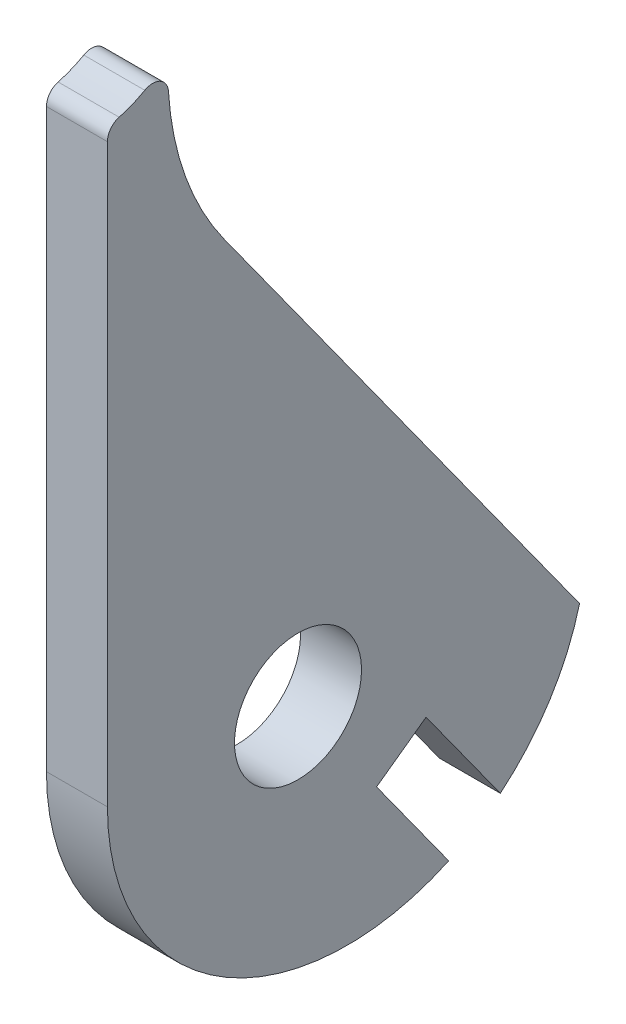
ISO-10303-21;
HEADER;
FILE_DESCRIPTION(('STEP AP214'),'2;1');
FILE_NAME('part.step','',(''),(''),'','','');
FILE_SCHEMA(('AUTOMOTIVE_DESIGN { 1 0 10303 214 1 1 1 1 }'));
ENDSEC;
DATA;
#1=APPLICATION_CONTEXT('core data for automotive mechanical design processes');
#2=APPLICATION_PROTOCOL_DEFINITION('international standard','automotive_design',2000,#1);
#3=PRODUCT_CONTEXT('',#1,'mechanical');
#4=PRODUCT('Part','Part','',(#3));
#5=PRODUCT_RELATED_PRODUCT_CATEGORY('part','',(#4));
#6=PRODUCT_DEFINITION_FORMATION('','',#4);
#7=PRODUCT_DEFINITION_CONTEXT('part definition',#1,'design');
#8=PRODUCT_DEFINITION('design','',#6,#7);
#9=PRODUCT_DEFINITION_SHAPE('','',#8);
#10=(LENGTH_UNIT() NAMED_UNIT(*) SI_UNIT(.MILLI.,.METRE.));
#11=(NAMED_UNIT(*) PLANE_ANGLE_UNIT() SI_UNIT($,.RADIAN.));
#12=(NAMED_UNIT(*) SI_UNIT($,.STERADIAN.) SOLID_ANGLE_UNIT());
#13=UNCERTAINTY_MEASURE_WITH_UNIT(LENGTH_MEASURE(1.E-05),#10,'distance_accuracy_value','');
#14=(GEOMETRIC_REPRESENTATION_CONTEXT(3) GLOBAL_UNCERTAINTY_ASSIGNED_CONTEXT((#13)) GLOBAL_UNIT_ASSIGNED_CONTEXT((#10,
#11,#12)) REPRESENTATION_CONTEXT('',''));
#15=CARTESIAN_POINT('',(0.,0.,0.));
#16=DIRECTION('',(0.,0.,1.));
#17=DIRECTION('',(1.,0.,0.));
#18=AXIS2_PLACEMENT_3D('',#15,#16,#17);
#19=CARTESIAN_POINT('',(1.524,0.413383536790552,-2.46354211660243));
#20=DIRECTION('',(-1.,0.,0.));
#21=DIRECTION('',(0.,0.,1.));
#22=AXIS2_PLACEMENT_3D('',#19,#20,#21);
#23=CYLINDRICAL_SURFACE('',#22,11.9885421166021);
#24=CARTESIAN_POINT('',(1.524,0.413383536790552,-2.46354211660243));
#25=DIRECTION('',(1.,0.,0.));
#26=DIRECTION('',(0.,0.,-1.));
#27=AXIS2_PLACEMENT_3D('',#24,#25,#26);
#28=CIRCLE('',#27,11.9885421166021);
#29=CARTESIAN_POINT('',(1.524,-8.81875511118318,-10.1115979523121));
#30=VERTEX_POINT('',#29);
#31=CARTESIAN_POINT('',(1.524,-2.58339994988699,-14.0714889986104));
#32=VERTEX_POINT('',#31);
#33=EDGE_CURVE('E100',#30,#32,#28,.T.);
#34=ORIENTED_EDGE('',*,*,#33,.F.);
#35=DIRECTION('',(1.,0.,0.));
#36=VECTOR('',#35,1.);
#37=CARTESIAN_POINT('',(-1.524,-8.81875511118318,-10.1115979523121));
#38=LINE('',#37,#36);
#39=CARTESIAN_POINT('',(-1.524,-8.81875511118318,-10.1115979523121));
#40=VERTEX_POINT('',#39);
#41=EDGE_CURVE('E201',#40,#30,#38,.T.);
#42=ORIENTED_EDGE('',*,*,#41,.F.);
#43=CARTESIAN_POINT('',(-1.524,0.413383536790552,-2.46354211660243));
#44=DIRECTION('',(1.,0.,0.));
#45=DIRECTION('',(0.,0.,-1.));
#46=AXIS2_PLACEMENT_3D('',#43,#44,#45);
#47=CIRCLE('',#46,11.9885421166021);
#48=CARTESIAN_POINT('',(-1.524,-2.58339994988699,-14.0714889986104));
#49=VERTEX_POINT('',#48);
#50=EDGE_CURVE('E209',#40,#49,#47,.T.);
#51=ORIENTED_EDGE('',*,*,#50,.T.);
#52=DIRECTION('',(-1.,0.,0.));
#53=VECTOR('',#52,1.);
#54=CARTESIAN_POINT('',(1.524,-2.58339994988699,-14.0714889986104));
#55=LINE('',#54,#53);
#56=EDGE_CURVE('E12',#32,#49,#55,.T.);
#57=ORIENTED_EDGE('',*,*,#56,.F.);
#58=EDGE_LOOP('',(#34,#42,#51,#57));
#59=FACE_BOUND('',#58,.T.);
#60=ADVANCED_FACE('F38',(#59),#23,.T.);
#61=CARTESIAN_POINT('',(-1.524,0.413383536790551,9.52499999999968));
#62=VERTEX_POINT('',#61);
#63=CARTESIAN_POINT('',(-1.524,-10.4514278119558,-7.53118618832796));
#64=VERTEX_POINT('',#63);
#65=EDGE_CURVE('E212',#62,#64,#47,.T.);
#66=ORIENTED_EDGE('',*,*,#65,.T.);
#67=DIRECTION('',(1.,0.,0.));
#68=VECTOR('',#67,1.);
#69=CARTESIAN_POINT('',(-1.524,-10.4514278119558,-7.53118618832796));
#70=LINE('',#69,#68);
#71=CARTESIAN_POINT('',(1.524,-10.4514278119558,-7.53118618832796));
#72=VERTEX_POINT('',#71);
#73=EDGE_CURVE('E53',#64,#72,#70,.T.);
#74=ORIENTED_EDGE('',*,*,#73,.T.);
#75=CARTESIAN_POINT('',(1.524,0.413383536790551,9.52499999999968));
#76=VERTEX_POINT('',#75);
#77=EDGE_CURVE('E157',#76,#72,#28,.T.);
#78=ORIENTED_EDGE('',*,*,#77,.F.);
#79=DIRECTION('',(-1.,0.,0.));
#80=VECTOR('',#79,1.);
#81=CARTESIAN_POINT('',(1.524,0.413383536790551,9.52499999999968));
#82=LINE('',#81,#80);
#83=EDGE_CURVE('E142',#76,#62,#82,.T.);
#84=ORIENTED_EDGE('',*,*,#83,.T.);
#85=EDGE_LOOP('',(#66,#74,#78,#84));
#86=FACE_BOUND('',#85,.T.);
#87=ADVANCED_FACE('F40',(#86),#23,.T.);
#88=CARTESIAN_POINT('',(1.524,-2.58339994988699,-14.0714889986104));
#89=DIRECTION('',(0.,-0.584619511040499,0.811307603385281));
#90=DIRECTION('',(0.,-0.811307603385281,-0.584619511040499));
#91=AXIS2_PLACEMENT_3D('',#88,#89,#90);
#92=PLANE('',#91);
#93=DIRECTION('',(0.,0.811307603385281,0.584619511040499));
#94=VECTOR('',#93,1.);
#95=CARTESIAN_POINT('',(-1.524,-2.58339994988699,-14.0714889986104));
#96=LINE('',#95,#94);
#97=CARTESIAN_POINT('',(-1.524,22.0657753877834,3.69044096892753));
#98=VERTEX_POINT('',#97);
#99=EDGE_CURVE('E389',#49,#98,#96,.T.);
#100=ORIENTED_EDGE('',*,*,#99,.T.);
#101=DIRECTION('',(-1.,0.,0.));
#102=VECTOR('',#101,1.);
#103=CARTESIAN_POINT('',(1.524,22.0657753877834,3.69044096892753));
#104=LINE('',#103,#102);
#105=CARTESIAN_POINT('',(1.524,22.0657753877834,3.69044096892753));
#106=VERTEX_POINT('',#105);
#107=EDGE_CURVE('E46',#106,#98,#104,.T.);
#108=ORIENTED_EDGE('',*,*,#107,.F.);
#109=DIRECTION('',(0.,0.811307603385281,0.584619511040499));
#110=VECTOR('',#109,1.);
#111=CARTESIAN_POINT('',(1.524,-2.58339994988699,-14.0714889986104));
#112=LINE('',#111,#110);
#113=EDGE_CURVE('E161',#32,#106,#112,.T.);
#114=ORIENTED_EDGE('',*,*,#113,.F.);
#115=ORIENTED_EDGE('',*,*,#56,.T.);
#116=EDGE_LOOP('',(#100,#108,#114,#115));
#117=FACE_BOUND('',#116,.T.);
#118=ADVANCED_FACE('F235',(#117),#92,.F.);
#119=CARTESIAN_POINT('',(1.524,30.7818369906919,-8.40530150369111));
#120=DIRECTION('',(-1.,0.,0.));
#121=DIRECTION('',(0.,0.,1.));
#122=AXIS2_PLACEMENT_3D('',#119,#120,#121);
#123=CYLINDRICAL_SURFACE('',#122,14.908947509117);
#124=CARTESIAN_POINT('',(-1.524,30.7818369906919,-8.40530150369111));
#125=DIRECTION('',(-1.,0.,0.));
#126=DIRECTION('',(0.,0.,-1.));
#127=AXIS2_PLACEMENT_3D('',#124,#125,#126);
#128=CIRCLE('',#127,14.908947509117);
#129=CARTESIAN_POINT('',(-1.524,29.8536631299509,6.47472568424919));
#130=VERTEX_POINT('',#129);
#131=EDGE_CURVE('E375',#98,#130,#128,.T.);
#132=ORIENTED_EDGE('',*,*,#131,.T.);
#133=DIRECTION('',(-1.,0.,0.));
#134=VECTOR('',#133,1.);
#135=CARTESIAN_POINT('',(1.524,29.8536631299509,6.47472568424919));
#136=LINE('',#135,#134);
#137=CARTESIAN_POINT('',(1.524,29.8536631299509,6.47472568424919));
#138=VERTEX_POINT('',#137);
#139=EDGE_CURVE('E373',#138,#130,#136,.T.);
#140=ORIENTED_EDGE('',*,*,#139,.F.);
#141=CARTESIAN_POINT('',(1.524,30.7818369906919,-8.40530150369111));
#142=DIRECTION('',(-1.,0.,0.));
#143=DIRECTION('',(0.,0.,-1.));
#144=AXIS2_PLACEMENT_3D('',#141,#142,#143);
#145=CIRCLE('',#144,14.908947509117);
#146=EDGE_CURVE('E173',#106,#138,#145,.T.);
#147=ORIENTED_EDGE('',*,*,#146,.F.);
#148=ORIENTED_EDGE('',*,*,#107,.T.);
#149=EDGE_LOOP('',(#132,#140,#147,#148));
#150=FACE_BOUND('',#149,.T.);
#151=ADVANCED_FACE('F326',(#150),#123,.F.);
#152=CARTESIAN_POINT('',(1.524,29.804247300865,7.26693597093813));
#153=DIRECTION('',(-1.,0.,0.));
#154=DIRECTION('',(0.,0.,1.));
#155=AXIS2_PLACEMENT_3D('',#152,#153,#154);
#156=CYLINDRICAL_SURFACE('',#155,0.793750000000017);
#157=CARTESIAN_POINT('',(-1.524,29.804247300865,7.26693597093813));
#158=DIRECTION('',(1.,0.,0.));
#159=DIRECTION('',(0.,0.,-1.));
#160=AXIS2_PLACEMENT_3D('',#157,#158,#159);
#161=CIRCLE('',#160,0.793750000000017);
#162=CARTESIAN_POINT('',(-1.524,30.4948429834671,7.65823721764098));
#163=VERTEX_POINT('',#162);
#164=EDGE_CURVE('E371',#130,#163,#161,.T.);
#165=ORIENTED_EDGE('',*,*,#164,.T.);
#166=DIRECTION('',(-1.,0.,0.));
#167=VECTOR('',#166,1.);
#168=CARTESIAN_POINT('',(1.524,30.4948429834671,7.65823721764098));
#169=LINE('',#168,#167);
#170=CARTESIAN_POINT('',(1.524,30.4948429834671,7.65823721764098));
#171=VERTEX_POINT('',#170);
#172=EDGE_CURVE('E135',#171,#163,#169,.T.);
#173=ORIENTED_EDGE('',*,*,#172,.F.);
#174=CARTESIAN_POINT('',(1.524,29.804247300865,7.26693597093813));
#175=DIRECTION('',(1.,0.,0.));
#176=DIRECTION('',(0.,0.,-1.));
#177=AXIS2_PLACEMENT_3D('',#174,#175,#176);
#178=CIRCLE('',#177,0.793750000000017);
#179=EDGE_CURVE('E122',#138,#171,#178,.T.);
#180=ORIENTED_EDGE('',*,*,#179,.F.);
#181=ORIENTED_EDGE('',*,*,#139,.T.);
#182=EDGE_LOOP('',(#165,#173,#180,#181));
#183=FACE_BOUND('',#182,.T.);
#184=ADVANCED_FACE('F332',(#183),#156,.T.);
#185=CARTESIAN_POINT('',(1.524,35.2842328638501,10.3719730233414));
#186=DIRECTION('',(-1.,0.,0.));
#187=DIRECTION('',(0.,0.,1.));
#188=AXIS2_PLACEMENT_3D('',#185,#186,#187);
#189=CYLINDRICAL_SURFACE('',#188,5.50478132621592);
#190=CARTESIAN_POINT('',(-1.524,35.2842328638501,10.3719730233414));
#191=DIRECTION('',(-1.,0.,0.));
#192=DIRECTION('',(0.,0.,-1.));
#193=AXIS2_PLACEMENT_3D('',#190,#191,#192);
#194=CIRCLE('',#193,5.50478132621592);
#195=CARTESIAN_POINT('',(-1.524,29.9694999908527,8.93801628126866));
#196=VERTEX_POINT('',#195);
#197=EDGE_CURVE('E132',#163,#196,#194,.T.);
#198=ORIENTED_EDGE('',*,*,#197,.T.);
#199=DIRECTION('',(-1.,0.,0.));
#200=VECTOR('',#199,1.);
#201=CARTESIAN_POINT('',(1.524,29.9694999908527,8.93801628126866));
#202=LINE('',#201,#200);
#203=CARTESIAN_POINT('',(1.524,29.9694999908527,8.93801628126866));
#204=VERTEX_POINT('',#203);
#205=EDGE_CURVE('E129',#204,#196,#202,.T.);
#206=ORIENTED_EDGE('',*,*,#205,.F.);
#207=CARTESIAN_POINT('',(1.524,35.2842328638501,10.3719730233414));
#208=DIRECTION('',(-1.,0.,0.));
#209=DIRECTION('',(0.,0.,-1.));
#210=AXIS2_PLACEMENT_3D('',#207,#208,#209);
#211=CIRCLE('',#210,5.50478132621592);
#212=EDGE_CURVE('E114',#171,#204,#211,.T.);
#213=ORIENTED_EDGE('',*,*,#212,.F.);
#214=ORIENTED_EDGE('',*,*,#172,.T.);
#215=EDGE_LOOP('',(#198,#206,#213,#214));
#216=FACE_BOUND('',#215,.T.);
#217=ADVANCED_FACE('F130',(#216),#189,.F.);
#218=CARTESIAN_POINT('',(1.524,29.2031536152299,8.73124999999969));
#219=DIRECTION('',(-1.,0.,0.));
#220=DIRECTION('',(0.,0.,1.));
#221=AXIS2_PLACEMENT_3D('',#218,#219,#220);
#222=CYLINDRICAL_SURFACE('',#221,0.79375);
#223=CARTESIAN_POINT('',(-1.524,29.2031536152299,8.73124999999969));
#224=DIRECTION('',(1.,0.,0.));
#225=DIRECTION('',(0.,0.,1.));
#226=AXIS2_PLACEMENT_3D('',#223,#224,#225);
#227=CIRCLE('',#226,0.79375);
#228=CARTESIAN_POINT('',(-1.524,29.2031536152299,9.52499999999969));
#229=VERTEX_POINT('',#228);
#230=EDGE_CURVE('E378',#196,#229,#227,.T.);
#231=ORIENTED_EDGE('',*,*,#230,.T.);
#232=DIRECTION('',(-1.,0.,0.));
#233=VECTOR('',#232,1.);
#234=CARTESIAN_POINT('',(1.524,29.2031536152299,9.52499999999969));
#235=LINE('',#234,#233);
#236=CARTESIAN_POINT('',(1.524,29.2031536152299,9.52499999999969));
#237=VERTEX_POINT('',#236);
#238=EDGE_CURVE('E136',#237,#229,#235,.T.);
#239=ORIENTED_EDGE('',*,*,#238,.F.);
#240=CARTESIAN_POINT('',(1.524,29.2031536152299,8.73124999999969));
#241=DIRECTION('',(1.,0.,0.));
#242=DIRECTION('',(0.,0.,1.));
#243=AXIS2_PLACEMENT_3D('',#240,#241,#242);
#244=CIRCLE('',#243,0.79375);
#245=EDGE_CURVE('E119',#204,#237,#244,.T.);
#246=ORIENTED_EDGE('',*,*,#245,.F.);
#247=ORIENTED_EDGE('',*,*,#205,.T.);
#248=EDGE_LOOP('',(#231,#239,#246,#247));
#249=FACE_BOUND('',#248,.T.);
#250=ADVANCED_FACE('F138',(#249),#222,.T.);
#251=CARTESIAN_POINT('',(1.524,29.2031536152299,9.52499999999969));
#252=DIRECTION('',(0.,0.,-1.));
#253=DIRECTION('',(0.,1.,0.));
#254=AXIS2_PLACEMENT_3D('',#251,#252,#253);
#255=PLANE('',#254);
#256=DIRECTION('',(0.,-1.,0.));
#257=VECTOR('',#256,1.);
#258=CARTESIAN_POINT('',(-1.524,29.2031536152299,9.52499999999969));
#259=LINE('',#258,#257);
#260=EDGE_CURVE('E92',#229,#62,#259,.T.);
#261=ORIENTED_EDGE('',*,*,#260,.T.);
#262=ORIENTED_EDGE('',*,*,#83,.F.);
#263=DIRECTION('',(0.,-1.,0.));
#264=VECTOR('',#263,1.);
#265=CARTESIAN_POINT('',(1.524,29.2031536152299,9.52499999999969));
#266=LINE('',#265,#264);
#267=EDGE_CURVE('E62',#237,#76,#266,.T.);
#268=ORIENTED_EDGE('',*,*,#267,.F.);
#269=ORIENTED_EDGE('',*,*,#238,.T.);
#270=EDGE_LOOP('',(#261,#262,#268,#269));
#271=FACE_BOUND('',#270,.T.);
#272=ADVANCED_FACE('F221',(#271),#255,.F.);
#273=CARTESIAN_POINT('',(1.524,0.413383536790552,-2.46354211660243));
#274=DIRECTION('',(1.,0.,0.));
#275=DIRECTION('',(0.,0.,-1.));
#276=AXIS2_PLACEMENT_3D('',#273,#274,#275);
#277=PLANE('',#276);
#278=DIRECTION('',(0.,0.811307603385281,0.584619511040499));
#279=VECTOR('',#278,1.);
#280=CARTESIAN_POINT('',(1.524,-3.66695182968665,-6.39926405720491));
#281=LINE('',#280,#279);
#282=CARTESIAN_POINT('',(1.524,-3.66695182968665,-6.39926405720491));
#283=VERTEX_POINT('',#282);
#284=EDGE_CURVE('E181',#30,#283,#281,.T.);
#285=ORIENTED_EDGE('',*,*,#284,.F.);
#286=ORIENTED_EDGE('',*,*,#33,.T.);
#287=ORIENTED_EDGE('',*,*,#113,.T.);
#288=ORIENTED_EDGE('',*,*,#146,.T.);
#289=ORIENTED_EDGE('',*,*,#179,.T.);
#290=ORIENTED_EDGE('',*,*,#212,.T.);
#291=ORIENTED_EDGE('',*,*,#245,.T.);
#292=ORIENTED_EDGE('',*,*,#267,.T.);
#293=ORIENTED_EDGE('',*,*,#77,.T.);
#294=DIRECTION('',(0.,-0.81130760338528,-0.584619511040499));
#295=VECTOR('',#294,1.);
#296=CARTESIAN_POINT('',(1.524,-5.4488720993381,-3.92639848208657));
#297=LINE('',#296,#295);
#298=CARTESIAN_POINT('',(1.524,-5.4488720993381,-3.92639848208657));
#299=VERTEX_POINT('',#298);
#300=EDGE_CURVE('E184',#299,#72,#297,.T.);
#301=ORIENTED_EDGE('',*,*,#300,.F.);
#302=DIRECTION('',(0.,-0.584619511040499,0.81130760338528));
#303=VECTOR('',#302,1.);
#304=CARTESIAN_POINT('',(1.524,-3.66695182968665,-6.39926405720491));
#305=LINE('',#304,#303);
#306=EDGE_CURVE('E193',#283,#299,#305,.T.);
#307=ORIENTED_EDGE('',*,*,#306,.F.);
#308=EDGE_LOOP('',(#285,#286,#287,#288,#289,#290,#291,#292,#293,#301,#307));
#309=FACE_BOUND('',#308,.T.);
#310=CARTESIAN_POINT('',(1.524,0.,0.));
#311=DIRECTION('',(1.,0.,0.));
#312=DIRECTION('',(0.,0.,-1.));
#313=AXIS2_PLACEMENT_3D('',#310,#311,#312);
#314=CIRCLE('',#313,3.175);
#315=CARTESIAN_POINT('',(1.524,0.,-3.175));
#316=VERTEX_POINT('',#315);
#317=EDGE_CURVE('E162',#316,#316,#314,.T.);
#318=ORIENTED_EDGE('',*,*,#317,.F.);
#319=EDGE_LOOP('',(#318));
#320=FACE_BOUND('',#319,.T.);
#321=ADVANCED_FACE('F116',(#309,#320),#277,.T.);
#322=CARTESIAN_POINT('',(-1.524,0.413383536790552,-2.46354211660243));
#323=DIRECTION('',(1.,0.,0.));
#324=DIRECTION('',(0.,0.,-1.));
#325=AXIS2_PLACEMENT_3D('',#322,#323,#324);
#326=PLANE('',#325);
#327=CARTESIAN_POINT('',(-1.524,0.,0.));
#328=DIRECTION('',(1.,0.,0.));
#329=DIRECTION('',(0.,0.,-1.));
#330=AXIS2_PLACEMENT_3D('',#327,#328,#329);
#331=CIRCLE('',#330,3.175);
#332=CARTESIAN_POINT('',(-1.524,0.,-3.175));
#333=VERTEX_POINT('',#332);
#334=EDGE_CURVE('E207',#333,#333,#331,.T.);
#335=ORIENTED_EDGE('',*,*,#334,.T.);
#336=EDGE_LOOP('',(#335));
#337=FACE_BOUND('',#336,.T.);
#338=ORIENTED_EDGE('',*,*,#50,.F.);
#339=DIRECTION('',(0.,0.811307603385281,0.584619511040499));
#340=VECTOR('',#339,1.);
#341=CARTESIAN_POINT('',(-1.524,-3.66695182968665,-6.39926405720491));
#342=LINE('',#341,#340);
#343=CARTESIAN_POINT('',(-1.524,-3.66695182968665,-6.39926405720491));
#344=VERTEX_POINT('',#343);
#345=EDGE_CURVE('E206',#40,#344,#342,.T.);
#346=ORIENTED_EDGE('',*,*,#345,.T.);
#347=DIRECTION('',(0.,-0.584619511040499,0.81130760338528));
#348=VECTOR('',#347,1.);
#349=CARTESIAN_POINT('',(-1.524,-3.66695182968665,-6.39926405720491));
#350=LINE('',#349,#348);
#351=CARTESIAN_POINT('',(-1.524,-5.4488720993381,-3.92639848208657));
#352=VERTEX_POINT('',#351);
#353=EDGE_CURVE('E183',#344,#352,#350,.T.);
#354=ORIENTED_EDGE('',*,*,#353,.T.);
#355=DIRECTION('',(0.,-0.81130760338528,-0.584619511040499));
#356=VECTOR('',#355,1.);
#357=CARTESIAN_POINT('',(-1.524,-5.4488720993381,-3.92639848208657));
#358=LINE('',#357,#356);
#359=EDGE_CURVE('E190',#352,#64,#358,.T.);
#360=ORIENTED_EDGE('',*,*,#359,.T.);
#361=ORIENTED_EDGE('',*,*,#65,.F.);
#362=ORIENTED_EDGE('',*,*,#260,.F.);
#363=ORIENTED_EDGE('',*,*,#230,.F.);
#364=ORIENTED_EDGE('',*,*,#197,.F.);
#365=ORIENTED_EDGE('',*,*,#164,.F.);
#366=ORIENTED_EDGE('',*,*,#131,.F.);
#367=ORIENTED_EDGE('',*,*,#99,.F.);
#368=EDGE_LOOP('',(#338,#346,#354,#360,#361,#362,#363,#364,#365,#366,#367));
#369=FACE_BOUND('',#368,.T.);
#370=ADVANCED_FACE('F220',(#337,#369),#326,.F.);
#371=CARTESIAN_POINT('',(-1.524,0.,0.));
#372=DIRECTION('',(1.,0.,0.));
#373=DIRECTION('',(0.,0.,-1.));
#374=AXIS2_PLACEMENT_3D('',#371,#372,#373);
#375=CYLINDRICAL_SURFACE('',#374,3.175);
#376=ORIENTED_EDGE('',*,*,#334,.F.);
#377=EDGE_LOOP('',(#376));
#378=FACE_BOUND('',#377,.T.);
#379=ORIENTED_EDGE('',*,*,#317,.T.);
#380=EDGE_LOOP('',(#379));
#381=FACE_BOUND('',#380,.T.);
#382=ADVANCED_FACE('F218',(#378,#381),#375,.F.);
#383=CARTESIAN_POINT('',(-1.524,-3.66695182968665,-6.39926405720491));
#384=DIRECTION('',(0.,0.81130760338528,0.584619511040499));
#385=DIRECTION('',(0.,-0.584619511040499,0.811307603385281));
#386=AXIS2_PLACEMENT_3D('',#383,#384,#385);
#387=PLANE('',#386);
#388=ORIENTED_EDGE('',*,*,#306,.T.);
#389=DIRECTION('',(1.,0.,0.));
#390=VECTOR('',#389,1.);
#391=CARTESIAN_POINT('',(-1.524,-5.4488720993381,-3.92639848208657));
#392=LINE('',#391,#390);
#393=EDGE_CURVE('E204',#352,#299,#392,.T.);
#394=ORIENTED_EDGE('',*,*,#393,.F.);
#395=ORIENTED_EDGE('',*,*,#353,.F.);
#396=DIRECTION('',(1.,0.,0.));
#397=VECTOR('',#396,1.);
#398=CARTESIAN_POINT('',(-1.524,-3.66695182968665,-6.39926405720491));
#399=LINE('',#398,#397);
#400=EDGE_CURVE('E198',#344,#283,#399,.T.);
#401=ORIENTED_EDGE('',*,*,#400,.T.);
#402=EDGE_LOOP('',(#388,#394,#395,#401));
#403=FACE_BOUND('',#402,.T.);
#404=ADVANCED_FACE('F255',(#403),#387,.F.);
#405=CARTESIAN_POINT('',(-1.524,-3.66695182968665,-6.39926405720491));
#406=DIRECTION('',(0.,0.584619511040499,-0.811307603385281));
#407=DIRECTION('',(0.,0.811307603385281,0.584619511040499));
#408=AXIS2_PLACEMENT_3D('',#405,#406,#407);
#409=PLANE('',#408);
#410=ORIENTED_EDGE('',*,*,#284,.T.);
#411=ORIENTED_EDGE('',*,*,#400,.F.);
#412=ORIENTED_EDGE('',*,*,#345,.F.);
#413=ORIENTED_EDGE('',*,*,#41,.T.);
#414=EDGE_LOOP('',(#410,#411,#412,#413));
#415=FACE_BOUND('',#414,.T.);
#416=ADVANCED_FACE('F266',(#415),#409,.F.);
#417=CARTESIAN_POINT('',(-1.524,-5.4488720993381,-3.92639848208657));
#418=DIRECTION('',(0.,-0.584619511040499,0.81130760338528));
#419=DIRECTION('',(0.,-0.81130760338528,-0.584619511040499));
#420=AXIS2_PLACEMENT_3D('',#417,#418,#419);
#421=PLANE('',#420);
#422=ORIENTED_EDGE('',*,*,#300,.T.);
#423=ORIENTED_EDGE('',*,*,#73,.F.);
#424=ORIENTED_EDGE('',*,*,#359,.F.);
#425=ORIENTED_EDGE('',*,*,#393,.T.);
#426=EDGE_LOOP('',(#422,#423,#424,#425));
#427=FACE_BOUND('',#426,.T.);
#428=ADVANCED_FACE('F258',(#427),#421,.F.);
#429=CLOSED_SHELL('',(#60,#87,#118,#151,#184,#217,#250,#272,#321,#370,#382,#404,#416,#428));
#430=MANIFOLD_SOLID_BREP('B2',#429);
#431=ADVANCED_BREP_SHAPE_REPRESENTATION('',(#18,#430),#14);
#432=SHAPE_DEFINITION_REPRESENTATION(#9,#431);
ENDSEC;
END-ISO-10303-21;
